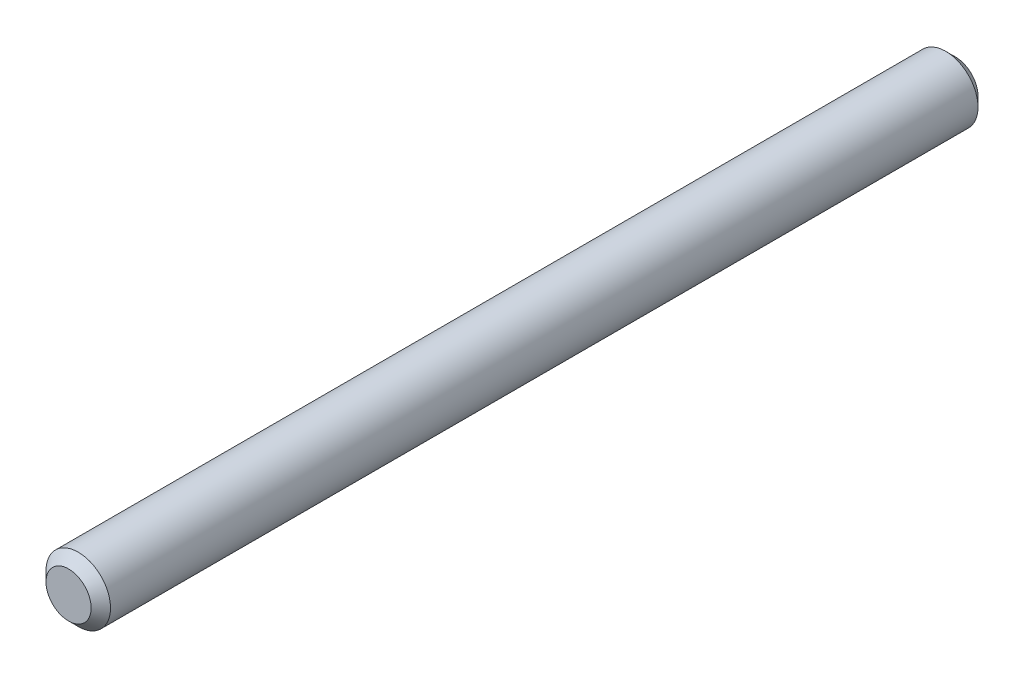
ISO-10303-21;
HEADER;
FILE_DESCRIPTION(('STEP AP214'),'2;1');
FILE_NAME('part.step','',(''),(''),'','','');
FILE_SCHEMA(('AUTOMOTIVE_DESIGN { 1 0 10303 214 1 1 1 1 }'));
ENDSEC;
DATA;
#1=APPLICATION_CONTEXT('core data for automotive mechanical design processes');
#2=APPLICATION_PROTOCOL_DEFINITION('international standard','automotive_design',2000,#1);
#3=PRODUCT_CONTEXT('',#1,'mechanical');
#4=PRODUCT('Part','Part','',(#3));
#5=PRODUCT_RELATED_PRODUCT_CATEGORY('part','',(#4));
#6=PRODUCT_DEFINITION_FORMATION('','',#4);
#7=PRODUCT_DEFINITION_CONTEXT('part definition',#1,'design');
#8=PRODUCT_DEFINITION('design','',#6,#7);
#9=PRODUCT_DEFINITION_SHAPE('','',#8);
#10=(LENGTH_UNIT() NAMED_UNIT(*) SI_UNIT(.MILLI.,.METRE.));
#11=(NAMED_UNIT(*) PLANE_ANGLE_UNIT() SI_UNIT($,.RADIAN.));
#12=(NAMED_UNIT(*) SI_UNIT($,.STERADIAN.) SOLID_ANGLE_UNIT());
#13=UNCERTAINTY_MEASURE_WITH_UNIT(LENGTH_MEASURE(1.E-05),#10,'distance_accuracy_value','');
#14=(GEOMETRIC_REPRESENTATION_CONTEXT(3) GLOBAL_UNCERTAINTY_ASSIGNED_CONTEXT((#13)) GLOBAL_UNIT_ASSIGNED_CONTEXT((#10,
#11,#12)) REPRESENTATION_CONTEXT('',''));
#15=CARTESIAN_POINT('',(0.,0.,0.));
#16=DIRECTION('',(0.,0.,1.));
#17=DIRECTION('',(1.,0.,0.));
#18=AXIS2_PLACEMENT_3D('',#15,#16,#17);
#19=CARTESIAN_POINT('',(0.,0.,-13.75));
#20=DIRECTION('',(0.,0.,1.));
#21=DIRECTION('',(1.,0.,0.));
#22=AXIS2_PLACEMENT_3D('',#19,#20,#21);
#23=PLANE('',#22);
#24=CARTESIAN_POINT('',(0.,0.,-13.7500000000159));
#25=DIRECTION('',(0.,0.,1.));
#26=DIRECTION('',(1.,0.,0.));
#27=AXIS2_PLACEMENT_3D('',#24,#25,#26);
#28=CIRCLE('',#27,0.699985556138927);
#29=CARTESIAN_POINT('',(0.699985556138927,0.,-13.7500000000159));
#30=VERTEX_POINT('',#29);
#31=EDGE_CURVE('E17',#30,#30,#28,.T.);
#32=ORIENTED_EDGE('',*,*,#31,.F.);
#33=EDGE_LOOP('',(#32));
#34=FACE_BOUND('',#33,.T.);
#35=ADVANCED_FACE('F14',(#34),#23,.F.);
#36=CARTESIAN_POINT('',(0.,0.,13.75));
#37=DIRECTION('',(0.,0.,1.));
#38=DIRECTION('',(1.,0.,0.));
#39=AXIS2_PLACEMENT_3D('',#36,#37,#38);
#40=PLANE('',#39);
#41=CARTESIAN_POINT('',(0.,0.,13.7500000000159));
#42=DIRECTION('',(0.,0.,-1.));
#43=DIRECTION('',(-1.,0.,0.));
#44=AXIS2_PLACEMENT_3D('',#41,#42,#43);
#45=CIRCLE('',#44,0.699985556138927);
#46=CARTESIAN_POINT('',(-0.699985556138927,0.,13.7500000000159));
#47=VERTEX_POINT('',#46);
#48=EDGE_CURVE('E26',#47,#47,#45,.T.);
#49=ORIENTED_EDGE('',*,*,#48,.F.);
#50=EDGE_LOOP('',(#49));
#51=FACE_BOUND('',#50,.T.);
#52=ADVANCED_FACE('F37',(#51),#40,.T.);
#53=CARTESIAN_POINT('',(0.,0.,-13.4499793654754));
#54=DIRECTION('',(0.,0.,1.));
#55=DIRECTION('',(1.,0.,0.));
#56=AXIS2_PLACEMENT_3D('',#53,#54,#55);
#57=CONICAL_SURFACE('',#56,0.999999999976353,0.7853878461622);
#58=CARTESIAN_POINT('',(0.,0.,-13.449979365443));
#59=DIRECTION('',(0.,0.,1.));
#60=DIRECTION('',(1.,0.,0.));
#61=AXIS2_PLACEMENT_3D('',#58,#59,#60);
#62=CIRCLE('',#61,1.);
#63=CARTESIAN_POINT('',(1.,0.,-13.449979365443));
#64=VERTEX_POINT('',#63);
#65=EDGE_CURVE('E21',#64,#64,#62,.T.);
#66=ORIENTED_EDGE('',*,*,#65,.F.);
#67=EDGE_LOOP('',(#66));
#68=FACE_BOUND('',#67,.T.);
#69=ORIENTED_EDGE('',*,*,#31,.T.);
#70=EDGE_LOOP('',(#69));
#71=FACE_BOUND('',#70,.T.);
#72=ADVANCED_FACE('F34',(#68,#71),#57,.T.);
#73=CARTESIAN_POINT('',(0.,0.,13.4499793654754));
#74=DIRECTION('',(0.,0.,-1.));
#75=DIRECTION('',(-1.,0.,0.));
#76=AXIS2_PLACEMENT_3D('',#73,#74,#75);
#77=CONICAL_SURFACE('',#76,0.999999999976353,0.7853878461622);
#78=CARTESIAN_POINT('',(0.,0.,13.449979365443));
#79=DIRECTION('',(0.,0.,1.));
#80=DIRECTION('',(1.,0.,0.));
#81=AXIS2_PLACEMENT_3D('',#78,#79,#80);
#82=CIRCLE('',#81,1.);
#83=CARTESIAN_POINT('',(1.,0.,13.449979365443));
#84=VERTEX_POINT('',#83);
#85=EDGE_CURVE('E10',#84,#84,#82,.F.);
#86=ORIENTED_EDGE('',*,*,#85,.F.);
#87=EDGE_LOOP('',(#86));
#88=FACE_BOUND('',#87,.T.);
#89=ORIENTED_EDGE('',*,*,#48,.T.);
#90=EDGE_LOOP('',(#89));
#91=FACE_BOUND('',#90,.T.);
#92=ADVANCED_FACE('F45',(#88,#91),#77,.T.);
#93=CARTESIAN_POINT('',(0.,0.,-13.75));
#94=DIRECTION('',(0.,0.,1.));
#95=DIRECTION('',(1.,0.,0.));
#96=AXIS2_PLACEMENT_3D('',#93,#94,#95);
#97=CYLINDRICAL_SURFACE('',#96,1.);
#98=ORIENTED_EDGE('',*,*,#85,.T.);
#99=EDGE_LOOP('',(#98));
#100=FACE_BOUND('',#99,.T.);
#101=ORIENTED_EDGE('',*,*,#65,.T.);
#102=EDGE_LOOP('',(#101));
#103=FACE_BOUND('',#102,.T.);
#104=ADVANCED_FACE('F43',(#100,#103),#97,.T.);
#105=CLOSED_SHELL('',(#35,#52,#72,#92,#104));
#106=MANIFOLD_SOLID_BREP('B1',#105);
#107=ADVANCED_BREP_SHAPE_REPRESENTATION('',(#18,#106),#14);
#108=SHAPE_DEFINITION_REPRESENTATION(#9,#107);
ENDSEC;
END-ISO-10303-21;
